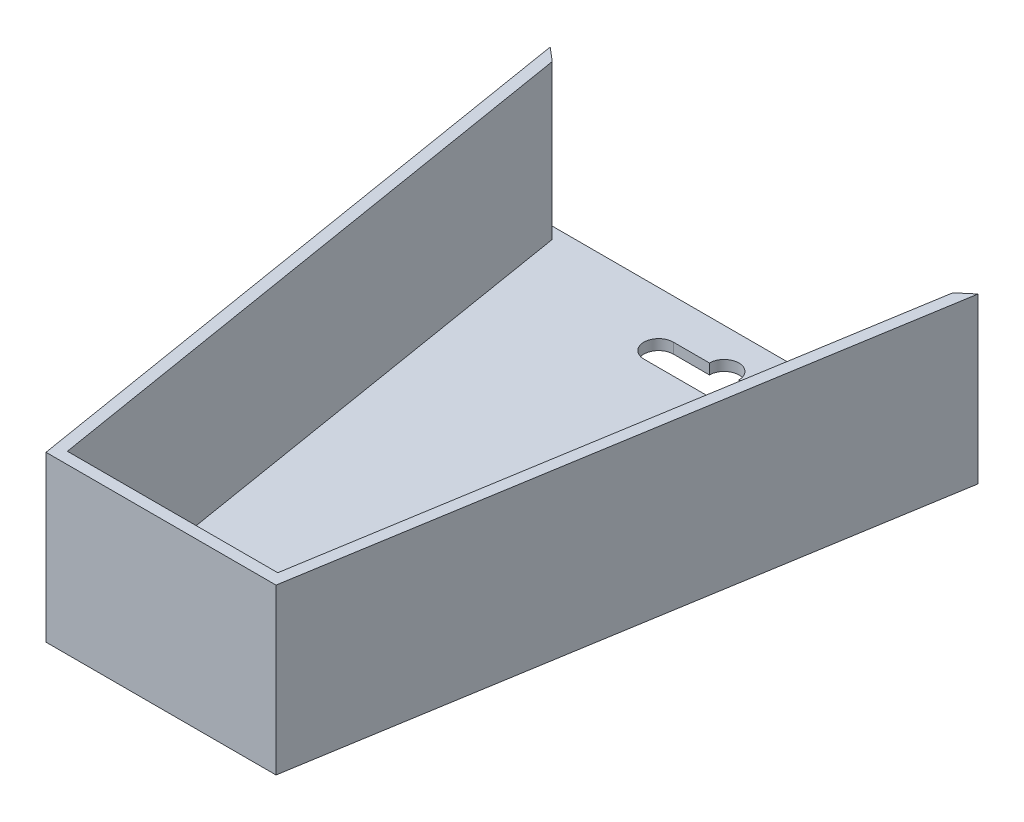
ISO-10303-21;
HEADER;
FILE_DESCRIPTION(('STEP AP214'),'2;1');
FILE_NAME('part.step','',(''),(''),'','','');
FILE_SCHEMA(('AUTOMOTIVE_DESIGN { 1 0 10303 214 1 1 1 1 }'));
ENDSEC;
DATA;
#1=APPLICATION_CONTEXT('core data for automotive mechanical design processes');
#2=APPLICATION_PROTOCOL_DEFINITION('international standard','automotive_design',2000,#1);
#3=PRODUCT_CONTEXT('',#1,'mechanical');
#4=PRODUCT('Part','Part','',(#3));
#5=PRODUCT_RELATED_PRODUCT_CATEGORY('part','',(#4));
#6=PRODUCT_DEFINITION_FORMATION('','',#4);
#7=PRODUCT_DEFINITION_CONTEXT('part definition',#1,'design');
#8=PRODUCT_DEFINITION('design','',#6,#7);
#9=PRODUCT_DEFINITION_SHAPE('','',#8);
#10=(LENGTH_UNIT() NAMED_UNIT(*) SI_UNIT(.MILLI.,.METRE.));
#11=(NAMED_UNIT(*) PLANE_ANGLE_UNIT() SI_UNIT($,.RADIAN.));
#12=(NAMED_UNIT(*) SI_UNIT($,.STERADIAN.) SOLID_ANGLE_UNIT());
#13=UNCERTAINTY_MEASURE_WITH_UNIT(LENGTH_MEASURE(1.E-05),#10,'distance_accuracy_value','');
#14=(GEOMETRIC_REPRESENTATION_CONTEXT(3) GLOBAL_UNCERTAINTY_ASSIGNED_CONTEXT((#13)) GLOBAL_UNIT_ASSIGNED_CONTEXT((#10,
#11,#12)) REPRESENTATION_CONTEXT('',''));
#15=CARTESIAN_POINT('',(0.,0.,0.));
#16=DIRECTION('',(0.,0.,1.));
#17=DIRECTION('',(1.,0.,0.));
#18=AXIS2_PLACEMENT_3D('',#15,#16,#17);
#19=CARTESIAN_POINT('',(-46.99,2.286,0.));
#20=DIRECTION('',(0.,0.,-1.));
#21=DIRECTION('',(-1.,0.,0.));
#22=AXIS2_PLACEMENT_3D('',#19,#20,#21);
#23=PLANE('',#22);
#24=DIRECTION('',(1.,0.,0.));
#25=VECTOR('',#24,1.);
#26=CARTESIAN_POINT('',(-46.99,0.,0.));
#27=LINE('',#26,#25);
#28=CARTESIAN_POINT('',(-46.99,0.,0.));
#29=VERTEX_POINT('',#28);
#30=CARTESIAN_POINT('',(46.99,0.,0.));
#31=VERTEX_POINT('',#30);
#32=EDGE_CURVE('E329',#29,#31,#27,.T.);
#33=ORIENTED_EDGE('',*,*,#32,.F.);
#34=DIRECTION('',(0.,-1.,0.));
#35=VECTOR('',#34,1.);
#36=CARTESIAN_POINT('',(-46.99,2.286,0.));
#37=LINE('',#36,#35);
#38=CARTESIAN_POINT('',(-46.99,2.286,0.));
#39=VERTEX_POINT('',#38);
#40=EDGE_CURVE('E12',#39,#29,#37,.T.);
#41=ORIENTED_EDGE('',*,*,#40,.F.);
#42=DIRECTION('',(1.,0.,0.));
#43=VECTOR('',#42,1.);
#44=CARTESIAN_POINT('',(-46.99,2.286,0.));
#45=LINE('',#44,#43);
#46=CARTESIAN_POINT('',(46.99,2.286,0.));
#47=VERTEX_POINT('',#46);
#48=EDGE_CURVE('E330',#39,#47,#45,.T.);
#49=ORIENTED_EDGE('',*,*,#48,.T.);
#50=DIRECTION('',(0.,-1.,0.));
#51=VECTOR('',#50,1.);
#52=CARTESIAN_POINT('',(46.99,2.286,0.));
#53=LINE('',#52,#51);
#54=EDGE_CURVE('E80',#47,#31,#53,.T.);
#55=ORIENTED_EDGE('',*,*,#54,.T.);
#56=EDGE_LOOP('',(#33,#41,#49,#55));
#57=FACE_BOUND('',#56,.T.);
#58=ADVANCED_FACE('F77',(#57),#23,.T.);
#59=CARTESIAN_POINT('',(-46.99,2.286,0.));
#60=DIRECTION('',(0.986822589476416,0.,-0.16180598536229));
#61=DIRECTION('',(-0.16180598536229,0.,-0.986822589476416));
#62=AXIS2_PLACEMENT_3D('',#59,#60,#61);
#63=PLANE('',#62);
#64=DIRECTION('',(0.16180598536229,0.,0.986822589476416));
#65=VECTOR('',#64,1.);
#66=CARTESIAN_POINT('',(-46.99,0.,0.));
#67=LINE('',#66,#65);
#68=CARTESIAN_POINT('',(-25.26665,0.,132.4864));
#69=VERTEX_POINT('',#68);
#70=EDGE_CURVE('E334',#29,#69,#67,.T.);
#71=ORIENTED_EDGE('',*,*,#70,.T.);
#72=DIRECTION('',(0.,-1.,0.));
#73=VECTOR('',#72,1.);
#74=CARTESIAN_POINT('',(-25.26665,2.286,132.4864));
#75=LINE('',#74,#73);
#76=CARTESIAN_POINT('',(-25.26665,36.1315,132.4864));
#77=VERTEX_POINT('',#76);
#78=EDGE_CURVE('E86',#77,#69,#75,.T.);
#79=ORIENTED_EDGE('',*,*,#78,.F.);
#80=DIRECTION('',(0.16180598536229,0.,0.986822589476416));
#81=VECTOR('',#80,1.);
#82=CARTESIAN_POINT('',(-45.7597464975131,36.1315,7.50307193098123));
#83=LINE('',#82,#81);
#84=CARTESIAN_POINT('',(-46.99,36.1315,0.));
#85=VERTEX_POINT('',#84);
#86=EDGE_CURVE('E227',#85,#77,#83,.T.);
#87=ORIENTED_EDGE('',*,*,#86,.F.);
#88=DIRECTION('',(0.,-1.,0.));
#89=VECTOR('',#88,1.);
#90=CARTESIAN_POINT('',(-46.99,36.1315,0.));
#91=LINE('',#90,#89);
#92=EDGE_CURVE('E239',#85,#39,#91,.T.);
#93=ORIENTED_EDGE('',*,*,#92,.T.);
#94=ORIENTED_EDGE('',*,*,#40,.T.);
#95=EDGE_LOOP('',(#71,#79,#87,#93,#94));
#96=FACE_BOUND('',#95,.T.);
#97=ADVANCED_FACE('F367',(#96),#63,.F.);
#98=CARTESIAN_POINT('',(-25.26665,2.286,132.4864));
#99=DIRECTION('',(0.,0.,-1.));
#100=DIRECTION('',(-1.,0.,0.));
#101=AXIS2_PLACEMENT_3D('',#98,#99,#100);
#102=PLANE('',#101);
#103=DIRECTION('',(1.,0.,0.));
#104=VECTOR('',#103,1.);
#105=CARTESIAN_POINT('',(-25.26665,0.,132.4864));
#106=LINE('',#105,#104);
#107=CARTESIAN_POINT('',(25.26665,0.,132.4864));
#108=VERTEX_POINT('',#107);
#109=EDGE_CURVE('E342',#69,#108,#106,.T.);
#110=ORIENTED_EDGE('',*,*,#109,.T.);
#111=DIRECTION('',(0.,-1.,0.));
#112=VECTOR('',#111,1.);
#113=CARTESIAN_POINT('',(25.26665,2.286,132.4864));
#114=LINE('',#113,#112);
#115=CARTESIAN_POINT('',(25.26665,36.1315,132.4864));
#116=VERTEX_POINT('',#115);
#117=EDGE_CURVE('E350',#116,#108,#114,.T.);
#118=ORIENTED_EDGE('',*,*,#117,.F.);
#119=DIRECTION('',(1.,0.,0.));
#120=VECTOR('',#119,1.);
#121=CARTESIAN_POINT('',(0.,36.1315,132.4864));
#122=LINE('',#121,#120);
#123=EDGE_CURVE('E231',#77,#116,#122,.T.);
#124=ORIENTED_EDGE('',*,*,#123,.F.);
#125=ORIENTED_EDGE('',*,*,#78,.T.);
#126=EDGE_LOOP('',(#110,#118,#124,#125));
#127=FACE_BOUND('',#126,.T.);
#128=ADVANCED_FACE('F371',(#127),#102,.F.);
#129=CARTESIAN_POINT('',(46.99,2.286,0.));
#130=DIRECTION('',(0.986822589476416,0.,0.16180598536229));
#131=DIRECTION('',(0.16180598536229,0.,-0.986822589476416));
#132=AXIS2_PLACEMENT_3D('',#129,#130,#131);
#133=PLANE('',#132);
#134=DIRECTION('',(-0.16180598536229,0.,0.986822589476416));
#135=VECTOR('',#134,1.);
#136=CARTESIAN_POINT('',(46.99,0.,0.));
#137=LINE('',#136,#135);
#138=EDGE_CURVE('E338',#31,#108,#137,.T.);
#139=ORIENTED_EDGE('',*,*,#138,.F.);
#140=ORIENTED_EDGE('',*,*,#54,.F.);
#141=DIRECTION('',(0.,-1.,0.));
#142=VECTOR('',#141,1.);
#143=CARTESIAN_POINT('',(46.99,36.1315,0.));
#144=LINE('',#143,#142);
#145=CARTESIAN_POINT('',(46.99,36.1315,0.));
#146=VERTEX_POINT('',#145);
#147=EDGE_CURVE('E236',#146,#47,#144,.T.);
#148=ORIENTED_EDGE('',*,*,#147,.F.);
#149=DIRECTION('',(-0.16180598536229,0.,0.986822589476416));
#150=VECTOR('',#149,1.);
#151=CARTESIAN_POINT('',(45.7597464975131,36.1315,7.50307193098123));
#152=LINE('',#151,#150);
#153=EDGE_CURVE('E213',#146,#116,#152,.T.);
#154=ORIENTED_EDGE('',*,*,#153,.T.);
#155=ORIENTED_EDGE('',*,*,#117,.T.);
#156=EDGE_LOOP('',(#139,#140,#148,#154,#155));
#157=FACE_BOUND('',#156,.T.);
#158=ADVANCED_FACE('F360',(#157),#133,.T.);
#159=CARTESIAN_POINT('',(0.,2.286,0.));
#160=DIRECTION('',(0.,-1.,0.));
#161=DIRECTION('',(0.,0.,-1.));
#162=AXIS2_PLACEMENT_3D('',#159,#160,#161);
#163=PLANE('',#162);
#164=CARTESIAN_POINT('',(0.,2.286,8.77378040730433));
#165=DIRECTION('',(0.,1.,0.));
#166=DIRECTION('',(0.,0.,1.));
#167=AXIS2_PLACEMENT_3D('',#164,#165,#166);
#168=CIRCLE('',#167,3.23310979634783);
#169=CARTESIAN_POINT('',(3.23310979634783,2.286,8.77378040730433));
#170=VERTEX_POINT('',#169);
#171=CARTESIAN_POINT('',(-3.23310979634783,2.286,8.77378040730433));
#172=VERTEX_POINT('',#171);
#173=EDGE_CURVE('E273',#170,#172,#168,.T.);
#174=ORIENTED_EDGE('',*,*,#173,.F.);
#175=DIRECTION('',(1.,0.,0.));
#176=VECTOR('',#175,1.);
#177=CARTESIAN_POINT('',(0.,2.286,8.77378040730433));
#178=LINE('',#177,#176);
#179=CARTESIAN_POINT('',(11.1633,2.286,8.77378040730433));
#180=VERTEX_POINT('',#179);
#181=EDGE_CURVE('E269',#170,#180,#178,.T.);
#182=ORIENTED_EDGE('',*,*,#181,.T.);
#183=CARTESIAN_POINT('',(11.1633,2.286,12.0068902036522));
#184=DIRECTION('',(0.,1.,0.));
#185=DIRECTION('',(0.,0.,1.));
#186=AXIS2_PLACEMENT_3D('',#183,#184,#185);
#187=CIRCLE('',#186,3.23310979634783);
#188=CARTESIAN_POINT('',(11.1633,2.286,15.24));
#189=VERTEX_POINT('',#188);
#190=EDGE_CURVE('E288',#180,#189,#187,.F.);
#191=ORIENTED_EDGE('',*,*,#190,.T.);
#192=DIRECTION('',(1.,0.,0.));
#193=VECTOR('',#192,1.);
#194=CARTESIAN_POINT('',(0.,2.286,15.24));
#195=LINE('',#194,#193);
#196=CARTESIAN_POINT('',(-11.1633,2.286,15.24));
#197=VERTEX_POINT('',#196);
#198=EDGE_CURVE('E285',#197,#189,#195,.T.);
#199=ORIENTED_EDGE('',*,*,#198,.F.);
#200=CARTESIAN_POINT('',(-11.1633,2.286,12.0068902036522));
#201=DIRECTION('',(0.,1.,0.));
#202=DIRECTION('',(0.,0.,1.));
#203=AXIS2_PLACEMENT_3D('',#200,#201,#202);
#204=CIRCLE('',#203,3.23310979634783);
#205=CARTESIAN_POINT('',(-11.1633,2.286,8.77378040730433));
#206=VERTEX_POINT('',#205);
#207=EDGE_CURVE('E281',#197,#206,#204,.F.);
#208=ORIENTED_EDGE('',*,*,#207,.T.);
#209=DIRECTION('',(1.,0.,0.));
#210=VECTOR('',#209,1.);
#211=CARTESIAN_POINT('',(0.,2.286,8.77378040730433));
#212=LINE('',#211,#210);
#213=EDGE_CURVE('E277',#206,#172,#212,.T.);
#214=ORIENTED_EDGE('',*,*,#213,.T.);
#215=EDGE_LOOP('',(#174,#182,#191,#199,#208,#214));
#216=FACE_BOUND('',#215,.T.);
#217=DIRECTION('',(-0.16180598536229,0.,0.986822589476416));
#218=VECTOR('',#217,1.);
#219=CARTESIAN_POINT('',(43.253217120243,2.286,7.09208472816101));
#220=LINE('',#219,#218);
#221=CARTESIAN_POINT('',(43.9996071631417,2.286,2.54));
#222=VERTEX_POINT('',#221);
#223=CARTESIAN_POINT('',(23.1092076999515,2.286,129.9464));
#224=VERTEX_POINT('',#223);
#225=EDGE_CURVE('E264',#222,#224,#220,.T.);
#226=ORIENTED_EDGE('',*,*,#225,.F.);
#227=DIRECTION('',(0.762169923757914,0.,-0.647377021000016));
#228=VECTOR('',#227,1.);
#229=CARTESIAN_POINT('',(19.693368373913,2.286,23.1853967397484));
#230=LINE('',#229,#228);
#231=EDGE_CURVE('E193',#222,#47,#230,.T.);
#232=ORIENTED_EDGE('',*,*,#231,.T.);
#233=ORIENTED_EDGE('',*,*,#48,.F.);
#234=DIRECTION('',(0.762169923757914,0.,0.647377021000016));
#235=VECTOR('',#234,1.);
#236=CARTESIAN_POINT('',(-19.693368373913,2.286,23.1853967397484));
#237=LINE('',#236,#235);
#238=CARTESIAN_POINT('',(-43.9996071631417,2.286,2.54));
#239=VERTEX_POINT('',#238);
#240=EDGE_CURVE('E197',#39,#239,#237,.T.);
#241=ORIENTED_EDGE('',*,*,#240,.T.);
#242=DIRECTION('',(0.16180598536229,0.,0.986822589476416));
#243=VECTOR('',#242,1.);
#244=CARTESIAN_POINT('',(-43.253217120243,2.286,7.09208472816101));
#245=LINE('',#244,#243);
#246=CARTESIAN_POINT('',(-23.1092076999515,2.286,129.9464));
#247=VERTEX_POINT('',#246);
#248=EDGE_CURVE('E256',#239,#247,#245,.T.);
#249=ORIENTED_EDGE('',*,*,#248,.T.);
#250=DIRECTION('',(1.,0.,0.));
#251=VECTOR('',#250,1.);
#252=CARTESIAN_POINT('',(0.,2.286,129.9464));
#253=LINE('',#252,#251);
#254=EDGE_CURVE('E260',#247,#224,#253,.T.);
#255=ORIENTED_EDGE('',*,*,#254,.T.);
#256=EDGE_LOOP('',(#226,#232,#233,#241,#249,#255));
#257=FACE_BOUND('',#256,.T.);
#258=ADVANCED_FACE('F374',(#216,#257),#163,.F.);
#259=CARTESIAN_POINT('',(0.,0.,0.));
#260=DIRECTION('',(0.,-1.,0.));
#261=DIRECTION('',(0.,0.,-1.));
#262=AXIS2_PLACEMENT_3D('',#259,#260,#261);
#263=PLANE('',#262);
#264=ORIENTED_EDGE('',*,*,#32,.T.);
#265=ORIENTED_EDGE('',*,*,#138,.T.);
#266=ORIENTED_EDGE('',*,*,#109,.F.);
#267=ORIENTED_EDGE('',*,*,#70,.F.);
#268=EDGE_LOOP('',(#264,#265,#266,#267));
#269=FACE_BOUND('',#268,.T.);
#270=DIRECTION('',(1.,0.,0.));
#271=VECTOR('',#270,1.);
#272=CARTESIAN_POINT('',(0.,0.,8.77378040730433));
#273=LINE('',#272,#271);
#274=CARTESIAN_POINT('',(3.23310979634783,0.,8.77378040730433));
#275=VERTEX_POINT('',#274);
#276=CARTESIAN_POINT('',(11.1633,0.,8.77378040730433));
#277=VERTEX_POINT('',#276);
#278=EDGE_CURVE('E102',#275,#277,#273,.T.);
#279=ORIENTED_EDGE('',*,*,#278,.F.);
#280=CARTESIAN_POINT('',(0.,0.,8.77378040730433));
#281=DIRECTION('',(0.,1.,0.));
#282=DIRECTION('',(0.,0.,1.));
#283=AXIS2_PLACEMENT_3D('',#280,#281,#282);
#284=CIRCLE('',#283,3.23310979634783);
#285=CARTESIAN_POINT('',(-3.23310979634783,0.,8.77378040730433));
#286=VERTEX_POINT('',#285);
#287=EDGE_CURVE('E295',#275,#286,#284,.T.);
#288=ORIENTED_EDGE('',*,*,#287,.T.);
#289=DIRECTION('',(1.,0.,0.));
#290=VECTOR('',#289,1.);
#291=CARTESIAN_POINT('',(0.,0.,8.77378040730433));
#292=LINE('',#291,#290);
#293=CARTESIAN_POINT('',(-11.1633,0.,8.77378040730433));
#294=VERTEX_POINT('',#293);
#295=EDGE_CURVE('E299',#294,#286,#292,.T.);
#296=ORIENTED_EDGE('',*,*,#295,.F.);
#297=CARTESIAN_POINT('',(-11.1633,0.,12.0068902036522));
#298=DIRECTION('',(0.,1.,0.));
#299=DIRECTION('',(0.,0.,1.));
#300=AXIS2_PLACEMENT_3D('',#297,#298,#299);
#301=CIRCLE('',#300,3.23310979634783);
#302=CARTESIAN_POINT('',(-11.1633,0.,15.24));
#303=VERTEX_POINT('',#302);
#304=EDGE_CURVE('E303',#303,#294,#301,.F.);
#305=ORIENTED_EDGE('',*,*,#304,.F.);
#306=DIRECTION('',(1.,0.,0.));
#307=VECTOR('',#306,1.);
#308=CARTESIAN_POINT('',(0.,0.,15.24));
#309=LINE('',#308,#307);
#310=CARTESIAN_POINT('',(11.1633,0.,15.24));
#311=VERTEX_POINT('',#310);
#312=EDGE_CURVE('E307',#303,#311,#309,.T.);
#313=ORIENTED_EDGE('',*,*,#312,.T.);
#314=CARTESIAN_POINT('',(11.1633,0.,12.0068902036522));
#315=DIRECTION('',(0.,1.,0.));
#316=DIRECTION('',(0.,0.,1.));
#317=AXIS2_PLACEMENT_3D('',#314,#315,#316);
#318=CIRCLE('',#317,3.23310979634783);
#319=EDGE_CURVE('E274',#277,#311,#318,.F.);
#320=ORIENTED_EDGE('',*,*,#319,.F.);
#321=EDGE_LOOP('',(#279,#288,#296,#305,#313,#320));
#322=FACE_BOUND('',#321,.T.);
#323=ADVANCED_FACE('F364',(#269,#322),#263,.T.);
#324=CARTESIAN_POINT('',(0.,2.286,8.77378040730433));
#325=DIRECTION('',(0.,0.,-1.));
#326=DIRECTION('',(-1.,0.,0.));
#327=AXIS2_PLACEMENT_3D('',#324,#325,#326);
#328=PLANE('',#327);
#329=ORIENTED_EDGE('',*,*,#278,.T.);
#330=DIRECTION('',(0.,-1.,0.));
#331=VECTOR('',#330,1.);
#332=CARTESIAN_POINT('',(11.1633,2.286,8.77378040730433));
#333=LINE('',#332,#331);
#334=EDGE_CURVE('E292',#180,#277,#333,.T.);
#335=ORIENTED_EDGE('',*,*,#334,.F.);
#336=ORIENTED_EDGE('',*,*,#181,.F.);
#337=DIRECTION('',(0.,-1.,0.));
#338=VECTOR('',#337,1.);
#339=CARTESIAN_POINT('',(3.23310979634783,2.286,8.77378040730433));
#340=LINE('',#339,#338);
#341=EDGE_CURVE('E326',#170,#275,#340,.T.);
#342=ORIENTED_EDGE('',*,*,#341,.T.);
#343=EDGE_LOOP('',(#329,#335,#336,#342));
#344=FACE_BOUND('',#343,.T.);
#345=ADVANCED_FACE('F410',(#344),#328,.F.);
#346=CARTESIAN_POINT('',(0.,2.286,8.77378040730433));
#347=DIRECTION('',(0.,-1.,0.));
#348=DIRECTION('',(0.,0.,-1.));
#349=AXIS2_PLACEMENT_3D('',#346,#347,#348);
#350=CYLINDRICAL_SURFACE('',#349,3.23310979634783);
#351=ORIENTED_EDGE('',*,*,#287,.F.);
#352=ORIENTED_EDGE('',*,*,#341,.F.);
#353=ORIENTED_EDGE('',*,*,#173,.T.);
#354=DIRECTION('',(0.,-1.,0.));
#355=VECTOR('',#354,1.);
#356=CARTESIAN_POINT('',(-3.23310979634783,2.286,8.77378040730433));
#357=LINE('',#356,#355);
#358=EDGE_CURVE('E323',#172,#286,#357,.T.);
#359=ORIENTED_EDGE('',*,*,#358,.T.);
#360=EDGE_LOOP('',(#351,#352,#353,#359));
#361=FACE_BOUND('',#360,.T.);
#362=ADVANCED_FACE('F415',(#361),#350,.F.);
#363=CARTESIAN_POINT('',(0.,2.286,8.77378040730433));
#364=DIRECTION('',(0.,0.,-1.));
#365=DIRECTION('',(-1.,0.,0.));
#366=AXIS2_PLACEMENT_3D('',#363,#364,#365);
#367=PLANE('',#366);
#368=ORIENTED_EDGE('',*,*,#295,.T.);
#369=ORIENTED_EDGE('',*,*,#358,.F.);
#370=ORIENTED_EDGE('',*,*,#213,.F.);
#371=DIRECTION('',(0.,-1.,0.));
#372=VECTOR('',#371,1.);
#373=CARTESIAN_POINT('',(-11.1633,2.286,8.77378040730433));
#374=LINE('',#373,#372);
#375=EDGE_CURVE('E320',#206,#294,#374,.T.);
#376=ORIENTED_EDGE('',*,*,#375,.T.);
#377=EDGE_LOOP('',(#368,#369,#370,#376));
#378=FACE_BOUND('',#377,.T.);
#379=ADVANCED_FACE('F418',(#378),#367,.F.);
#380=CARTESIAN_POINT('',(-11.1633,2.286,12.0068902036522));
#381=DIRECTION('',(0.,-1.,0.));
#382=DIRECTION('',(0.,0.,-1.));
#383=AXIS2_PLACEMENT_3D('',#380,#381,#382);
#384=CYLINDRICAL_SURFACE('',#383,3.23310979634783);
#385=ORIENTED_EDGE('',*,*,#304,.T.);
#386=ORIENTED_EDGE('',*,*,#375,.F.);
#387=ORIENTED_EDGE('',*,*,#207,.F.);
#388=DIRECTION('',(0.,-1.,0.));
#389=VECTOR('',#388,1.);
#390=CARTESIAN_POINT('',(-11.1633,2.286,15.24));
#391=LINE('',#390,#389);
#392=EDGE_CURVE('E317',#197,#303,#391,.T.);
#393=ORIENTED_EDGE('',*,*,#392,.T.);
#394=EDGE_LOOP('',(#385,#386,#387,#393));
#395=FACE_BOUND('',#394,.T.);
#396=ADVANCED_FACE('F422',(#395),#384,.F.);
#397=CARTESIAN_POINT('',(0.,2.286,15.24));
#398=DIRECTION('',(0.,0.,-1.));
#399=DIRECTION('',(-1.,0.,0.));
#400=AXIS2_PLACEMENT_3D('',#397,#398,#399);
#401=PLANE('',#400);
#402=ORIENTED_EDGE('',*,*,#312,.F.);
#403=ORIENTED_EDGE('',*,*,#392,.F.);
#404=ORIENTED_EDGE('',*,*,#198,.T.);
#405=DIRECTION('',(0.,-1.,0.));
#406=VECTOR('',#405,1.);
#407=CARTESIAN_POINT('',(11.1633,2.286,15.24));
#408=LINE('',#407,#406);
#409=EDGE_CURVE('E94',#189,#311,#408,.T.);
#410=ORIENTED_EDGE('',*,*,#409,.T.);
#411=EDGE_LOOP('',(#402,#403,#404,#410));
#412=FACE_BOUND('',#411,.T.);
#413=ADVANCED_FACE('F426',(#412),#401,.T.);
#414=CARTESIAN_POINT('',(11.1633,2.286,12.0068902036522));
#415=DIRECTION('',(0.,-1.,0.));
#416=DIRECTION('',(0.,0.,-1.));
#417=AXIS2_PLACEMENT_3D('',#414,#415,#416);
#418=CYLINDRICAL_SURFACE('',#417,3.23310979634783);
#419=ORIENTED_EDGE('',*,*,#319,.T.);
#420=ORIENTED_EDGE('',*,*,#409,.F.);
#421=ORIENTED_EDGE('',*,*,#190,.F.);
#422=ORIENTED_EDGE('',*,*,#334,.T.);
#423=EDGE_LOOP('',(#419,#420,#421,#422));
#424=FACE_BOUND('',#423,.T.);
#425=ADVANCED_FACE('F430',(#424),#418,.F.);
#426=CARTESIAN_POINT('',(19.693368373913,36.1315,23.1853967397484));
#427=DIRECTION('',(-0.647377021000016,0.,-0.762169923757914));
#428=DIRECTION('',(-0.762169923757914,0.,0.647377021000016));
#429=AXIS2_PLACEMENT_3D('',#426,#427,#428);
#430=PLANE('',#429);
#431=ORIENTED_EDGE('',*,*,#231,.F.);
#432=DIRECTION('',(0.,-1.,0.));
#433=VECTOR('',#432,1.);
#434=CARTESIAN_POINT('',(43.9996071631417,36.1315,2.54));
#435=LINE('',#434,#433);
#436=CARTESIAN_POINT('',(43.9996071631417,36.1315,2.54));
#437=VERTEX_POINT('',#436);
#438=EDGE_CURVE('E186',#437,#222,#435,.T.);
#439=ORIENTED_EDGE('',*,*,#438,.F.);
#440=DIRECTION('',(0.762169923757914,0.,-0.647377021000016));
#441=VECTOR('',#440,1.);
#442=CARTESIAN_POINT('',(19.693368373913,36.1315,23.1853967397484));
#443=LINE('',#442,#441);
#444=EDGE_CURVE('E190',#437,#146,#443,.T.);
#445=ORIENTED_EDGE('',*,*,#444,.T.);
#446=ORIENTED_EDGE('',*,*,#147,.T.);
#447=EDGE_LOOP('',(#431,#439,#445,#446));
#448=FACE_BOUND('',#447,.T.);
#449=ADVANCED_FACE('F188',(#448),#430,.T.);
#450=CARTESIAN_POINT('',(43.253217120243,36.1315,7.09208472816101));
#451=DIRECTION('',(0.986822589476416,0.,0.16180598536229));
#452=DIRECTION('',(0.16180598536229,0.,-0.986822589476416));
#453=AXIS2_PLACEMENT_3D('',#450,#451,#452);
#454=PLANE('',#453);
#455=ORIENTED_EDGE('',*,*,#438,.T.);
#456=ORIENTED_EDGE('',*,*,#225,.T.);
#457=DIRECTION('',(0.,-1.,0.));
#458=VECTOR('',#457,1.);
#459=CARTESIAN_POINT('',(23.1092076999515,36.1315,129.9464));
#460=LINE('',#459,#458);
#461=CARTESIAN_POINT('',(23.1092076999515,36.1315,129.9464));
#462=VERTEX_POINT('',#461);
#463=EDGE_CURVE('E198',#462,#224,#460,.T.);
#464=ORIENTED_EDGE('',*,*,#463,.F.);
#465=DIRECTION('',(-0.16180598536229,0.,0.986822589476416));
#466=VECTOR('',#465,1.);
#467=CARTESIAN_POINT('',(43.253217120243,36.1315,7.09208472816101));
#468=LINE('',#467,#466);
#469=EDGE_CURVE('E201',#437,#462,#468,.T.);
#470=ORIENTED_EDGE('',*,*,#469,.F.);
#471=EDGE_LOOP('',(#455,#456,#464,#470));
#472=FACE_BOUND('',#471,.T.);
#473=ADVANCED_FACE('F202',(#472),#454,.F.);
#474=CARTESIAN_POINT('',(0.,36.1315,129.9464));
#475=DIRECTION('',(0.,0.,-1.));
#476=DIRECTION('',(-1.,0.,0.));
#477=AXIS2_PLACEMENT_3D('',#474,#475,#476);
#478=PLANE('',#477);
#479=ORIENTED_EDGE('',*,*,#254,.F.);
#480=DIRECTION('',(0.,-1.,0.));
#481=VECTOR('',#480,1.);
#482=CARTESIAN_POINT('',(-23.1092076999515,36.1315,129.9464));
#483=LINE('',#482,#481);
#484=CARTESIAN_POINT('',(-23.1092076999515,36.1315,129.9464));
#485=VERTEX_POINT('',#484);
#486=EDGE_CURVE('E247',#485,#247,#483,.T.);
#487=ORIENTED_EDGE('',*,*,#486,.F.);
#488=DIRECTION('',(1.,0.,0.));
#489=VECTOR('',#488,1.);
#490=CARTESIAN_POINT('',(0.,36.1315,129.9464));
#491=LINE('',#490,#489);
#492=EDGE_CURVE('E208',#485,#462,#491,.T.);
#493=ORIENTED_EDGE('',*,*,#492,.T.);
#494=ORIENTED_EDGE('',*,*,#463,.T.);
#495=EDGE_LOOP('',(#479,#487,#493,#494));
#496=FACE_BOUND('',#495,.T.);
#497=ADVANCED_FACE('F376',(#496),#478,.T.);
#498=CARTESIAN_POINT('',(-43.253217120243,36.1315,7.09208472816101));
#499=DIRECTION('',(0.986822589476416,0.,-0.16180598536229));
#500=DIRECTION('',(-0.16180598536229,0.,-0.986822589476416));
#501=AXIS2_PLACEMENT_3D('',#498,#499,#500);
#502=PLANE('',#501);
#503=ORIENTED_EDGE('',*,*,#248,.F.);
#504=DIRECTION('',(0.,-1.,0.));
#505=VECTOR('',#504,1.);
#506=CARTESIAN_POINT('',(-43.9996071631417,36.1315,2.54));
#507=LINE('',#506,#505);
#508=CARTESIAN_POINT('',(-43.9996071631417,36.1315,2.54));
#509=VERTEX_POINT('',#508);
#510=EDGE_CURVE('E243',#509,#239,#507,.T.);
#511=ORIENTED_EDGE('',*,*,#510,.F.);
#512=DIRECTION('',(0.16180598536229,0.,0.986822589476416));
#513=VECTOR('',#512,1.);
#514=CARTESIAN_POINT('',(-43.253217120243,36.1315,7.09208472816101));
#515=LINE('',#514,#513);
#516=EDGE_CURVE('E219',#509,#485,#515,.T.);
#517=ORIENTED_EDGE('',*,*,#516,.T.);
#518=ORIENTED_EDGE('',*,*,#486,.T.);
#519=EDGE_LOOP('',(#503,#511,#517,#518));
#520=FACE_BOUND('',#519,.T.);
#521=ADVANCED_FACE('F379',(#520),#502,.T.);
#522=CARTESIAN_POINT('',(-19.693368373913,36.1315,23.1853967397484));
#523=DIRECTION('',(0.647377021000016,0.,-0.762169923757914));
#524=DIRECTION('',(-0.762169923757914,0.,-0.647377021000016));
#525=AXIS2_PLACEMENT_3D('',#522,#523,#524);
#526=PLANE('',#525);
#527=ORIENTED_EDGE('',*,*,#240,.F.);
#528=ORIENTED_EDGE('',*,*,#92,.F.);
#529=DIRECTION('',(0.762169923757914,0.,0.647377021000016));
#530=VECTOR('',#529,1.);
#531=CARTESIAN_POINT('',(-19.693368373913,36.1315,23.1853967397484));
#532=LINE('',#531,#530);
#533=EDGE_CURVE('E223',#85,#509,#532,.T.);
#534=ORIENTED_EDGE('',*,*,#533,.T.);
#535=ORIENTED_EDGE('',*,*,#510,.T.);
#536=EDGE_LOOP('',(#527,#528,#534,#535));
#537=FACE_BOUND('',#536,.T.);
#538=ADVANCED_FACE('F381',(#537),#526,.T.);
#539=CARTESIAN_POINT('',(0.,36.1315,0.));
#540=DIRECTION('',(0.,1.,0.));
#541=DIRECTION('',(0.,0.,1.));
#542=AXIS2_PLACEMENT_3D('',#539,#540,#541);
#543=PLANE('',#542);
#544=ORIENTED_EDGE('',*,*,#444,.F.);
#545=ORIENTED_EDGE('',*,*,#469,.T.);
#546=ORIENTED_EDGE('',*,*,#492,.F.);
#547=ORIENTED_EDGE('',*,*,#516,.F.);
#548=ORIENTED_EDGE('',*,*,#533,.F.);
#549=ORIENTED_EDGE('',*,*,#86,.T.);
#550=ORIENTED_EDGE('',*,*,#123,.T.);
#551=ORIENTED_EDGE('',*,*,#153,.F.);
#552=EDGE_LOOP('',(#544,#545,#546,#547,#548,#549,#550,#551));
#553=FACE_BOUND('',#552,.T.);
#554=ADVANCED_FACE('F210',(#553),#543,.T.);
#555=CLOSED_SHELL('',(#58,#97,#128,#158,#258,#323,#345,#362,#379,#396,#413,#425,#449,#473,#497,
#521,#538,#554));
#556=MANIFOLD_SOLID_BREP('B2',#555);
#557=ADVANCED_BREP_SHAPE_REPRESENTATION('',(#18,#556),#14);
#558=SHAPE_DEFINITION_REPRESENTATION(#9,#557);
ENDSEC;
END-ISO-10303-21;
